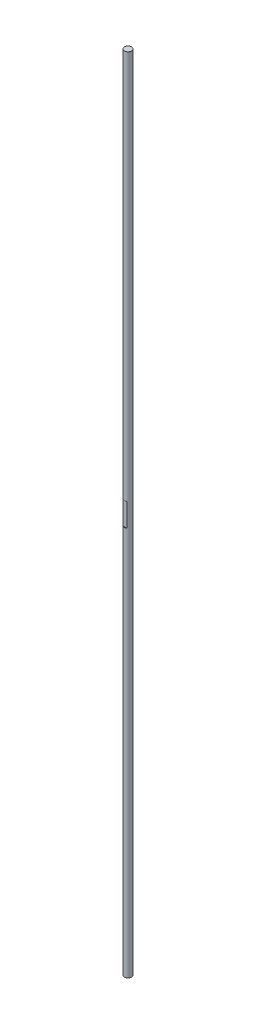
ISO-10303-21;
HEADER;
FILE_DESCRIPTION(('STEP AP214'),'2;1');
FILE_NAME('part.step','',(''),(''),'','','');
FILE_SCHEMA(('AUTOMOTIVE_DESIGN { 1 0 10303 214 1 1 1 1 }'));
ENDSEC;
DATA;
#1=APPLICATION_CONTEXT('core data for automotive mechanical design processes');
#2=APPLICATION_PROTOCOL_DEFINITION('international standard','automotive_design',2000,#1);
#3=PRODUCT_CONTEXT('',#1,'mechanical');
#4=PRODUCT('Part','Part','',(#3));
#5=PRODUCT_RELATED_PRODUCT_CATEGORY('part','',(#4));
#6=PRODUCT_DEFINITION_FORMATION('','',#4);
#7=PRODUCT_DEFINITION_CONTEXT('part definition',#1,'design');
#8=PRODUCT_DEFINITION('design','',#6,#7);
#9=PRODUCT_DEFINITION_SHAPE('','',#8);
#10=(LENGTH_UNIT() NAMED_UNIT(*) SI_UNIT(.MILLI.,.METRE.));
#11=(NAMED_UNIT(*) PLANE_ANGLE_UNIT() SI_UNIT($,.RADIAN.));
#12=(NAMED_UNIT(*) SI_UNIT($,.STERADIAN.) SOLID_ANGLE_UNIT());
#13=UNCERTAINTY_MEASURE_WITH_UNIT(LENGTH_MEASURE(1.E-05),#10,'distance_accuracy_value','');
#14=(GEOMETRIC_REPRESENTATION_CONTEXT(3) GLOBAL_UNCERTAINTY_ASSIGNED_CONTEXT((#13)) GLOBAL_UNIT_ASSIGNED_CONTEXT((#10,
#11,#12)) REPRESENTATION_CONTEXT('',''));
#15=CARTESIAN_POINT('',(0.,0.,0.));
#16=DIRECTION('',(0.,0.,1.));
#17=DIRECTION('',(1.,0.,0.));
#18=AXIS2_PLACEMENT_3D('',#15,#16,#17);
#19=CARTESIAN_POINT('',(51.5,-400.,247.));
#20=DIRECTION('',(0.,0.,-1.));
#21=DIRECTION('',(1.,0.,0.));
#22=AXIS2_PLACEMENT_3D('',#19,#20,#21);
#23=CYLINDRICAL_SURFACE('',#22,11.5);
#24=CARTESIAN_POINT('',(49.5404082059178,-388.668186377608,247.000000000098));
#25=CARTESIAN_POINT('',(49.5802265716879,-388.661301156045,247.026906778185));
#26=CARTESIAN_POINT('',(49.6206156905365,-388.654549375887,247.053003363505));
#27=CARTESIAN_POINT('',(49.7013684381463,-388.641515799974,247.102850981387));
#28=CARTESIAN_POINT('',(49.7417035325189,-388.635226247589,247.126646222982));
#29=CARTESIAN_POINT('',(49.822204416103,-388.623116839328,247.171982563202));
#30=CARTESIAN_POINT('',(49.862344146186,-388.617288810584,247.193567752785));
#31=CARTESIAN_POINT('',(49.9423209305092,-388.606103100956,247.234580960985));
#32=CARTESIAN_POINT('',(49.9821343153288,-388.600736770603,247.254052781727));
#33=CARTESIAN_POINT('',(50.0613358911731,-388.590474833857,247.290939987841));
#34=CARTESIAN_POINT('',(50.1007026955651,-388.585570069863,247.30839874868));
#35=CARTESIAN_POINT('',(50.1788989656807,-388.576232052942,247.341363614543));
#36=CARTESIAN_POINT('',(50.2177092228905,-388.571789078852,247.356912535919));
#37=CARTESIAN_POINT('',(50.2946903549696,-388.563374353632,247.386163636664));
#38=CARTESIAN_POINT('',(50.3328440910623,-388.559392301951,247.399907952862));
#39=CARTESIAN_POINT('',(50.4084197015294,-388.551903134911,247.425657109712));
#40=CARTESIAN_POINT('',(50.4458264027495,-388.548384961264,247.437703297109));
#41=CARTESIAN_POINT('',(50.525573279814,-388.541302800022,247.461908857835));
#42=CARTESIAN_POINT('',(50.5679662481753,-388.537784088522,247.47390795853));
#43=CARTESIAN_POINT('',(50.6528783635187,-388.531216704423,247.496218053491));
#44=CARTESIAN_POINT('',(50.6953940152595,-388.528164615717,247.506541354391));
#45=CARTESIAN_POINT('',(50.7804836777305,-388.522533736677,247.525519191767));
#46=CARTESIAN_POINT('',(50.8230547402374,-388.519951496019,247.534185919211));
#47=CARTESIAN_POINT('',(50.9081886750384,-388.515259461159,247.549872247178));
#48=CARTESIAN_POINT('',(50.950749136926,-388.513146216207,247.556903897834));
#49=CARTESIAN_POINT('',(51.0357976860111,-388.509392407807,247.569344203744));
#50=CARTESIAN_POINT('',(51.0782838823516,-388.507748387404,247.574764741622));
#51=CARTESIAN_POINT('',(51.1631218714194,-388.504932968074,247.584009207369));
#52=CARTESIAN_POINT('',(51.205472275454,-388.503758110849,247.587844825586));
#53=CARTESIAN_POINT('',(51.2899789311621,-388.501881047294,247.593947968214));
#54=CARTESIAN_POINT('',(51.3321342772806,-388.501175383426,247.596226967004));
#55=CARTESIAN_POINT('',(51.416193377034,-388.50023665462,247.599247364856));
#56=CARTESIAN_POINT('',(51.4580966883201,-388.50000013643,247.599999999991));
#57=CARTESIAN_POINT('',(51.5418964669691,-388.499999863593,247.600000000009));
#58=CARTESIAN_POINT('',(51.5837929343318,-388.500236031729,247.59924761075));
#59=CARTESIAN_POINT('',(51.6678403274889,-388.501174195813,247.596228127186));
#60=CARTESIAN_POINT('',(51.7099908082962,-388.501879668163,247.593949727995));
#61=CARTESIAN_POINT('',(51.7944897247599,-388.503756394353,247.587847998484));
#62=CARTESIAN_POINT('',(51.8368372494591,-388.504931127567,247.584013124055));
#63=CARTESIAN_POINT('',(51.9216714672081,-388.507746369338,247.574770148297));
#64=CARTESIAN_POINT('',(51.9641567633245,-388.509390357576,247.569350286102));
#65=CARTESIAN_POINT('',(52.0492054791702,-388.513144167399,247.556911120564));
#66=CARTESIAN_POINT('',(52.0917669968805,-388.515257466644,247.549879863426));
#67=CARTESIAN_POINT('',(52.1769049748802,-388.519949673379,247.534193896992));
#68=CARTESIAN_POINT('',(52.2194790106125,-388.522532051652,247.525527065879));
#69=CARTESIAN_POINT('',(52.3045764967026,-388.528163287912,247.506548381966));
#70=CARTESIAN_POINT('',(52.3470969816013,-388.531215615794,247.496224266151));
#71=CARTESIAN_POINT('',(52.4320205773531,-388.537783490753,247.473911687219));
#72=CARTESIAN_POINT('',(52.4744201726778,-388.541302472184,247.461910845181));
#73=CARTESIAN_POINT('',(52.5541696382366,-388.548384383302,247.437704498804));
#74=CARTESIAN_POINT('',(52.5915724251673,-388.551901932477,247.42565964507));
#75=CARTESIAN_POINT('',(52.6671414187627,-388.559390054133,247.399913041677));
#76=CARTESIAN_POINT('',(52.7052924393561,-388.563371699724,247.386169910926));
#77=CARTESIAN_POINT('',(52.7822693307091,-388.571785756128,247.356920956822));
#78=CARTESIAN_POINT('',(52.8210780479496,-388.576228478697,247.341372960254));
#79=CARTESIAN_POINT('',(52.8992723912365,-388.585566154712,247.308409606207));
#80=CARTESIAN_POINT('',(52.9386387917996,-388.590470839844,247.290951394145));
#81=CARTESIAN_POINT('',(53.0178406665885,-388.600732777273,247.254064829705));
#82=CARTESIAN_POINT('',(53.0576547348162,-388.606099196414,247.234593061917));
#83=CARTESIAN_POINT('',(53.1376339335556,-388.617285244519,247.193579382851));
#84=CARTESIAN_POINT('',(53.1777753726463,-388.623113531258,247.171993627976));
#85=CARTESIAN_POINT('',(53.2582806499379,-388.635223616669,247.126655457676));
#86=CARTESIAN_POINT('',(53.2986184041475,-388.641513595623,247.102858908493));
#87=CARTESIAN_POINT('',(53.3793773611664,-388.654548187854,247.053007853002));
#88=CARTESIAN_POINT('',(53.4197700016454,-388.661300564458,247.026909093778));
#89=CARTESIAN_POINT('',(53.4595917940823,-388.668186377608,247.000000000098));
#90=B_SPLINE_CURVE_WITH_KNOTS('',3,(#24,#25,#26,#27,#28,#29,#30,#31,#32,#33,#34,#35,#36,#37,#38,
#39,#40,#41,#42,#43,#44,#45,#46,#47,#48,#49,#50,#51,#52,#53,#54,#55,#56,#57,#58,#59,#60,#61,#62,
#63,#64,#65,#66,#67,#68,#69,#70,#71,#72,#73,#74,#75,#76,#77,#78,#79,#80,#81,#82,#83,#84,#85,#86,
#87,#88,#89),.UNSPECIFIED.,.F.,.F.,(4,2,2,2,2,2,2,2,2,2,2,2,2,2,2,2,2,2,2,2,2,2,2,2,2,2,2,2,2,2,
2,2,4),(0.,0.145633057423325,0.28734898562899,0.425153120973846,0.55905127202127,
0.689049775429505,0.815155560239854,0.93737622209787,1.05572010927034,1.18828186107212,
1.31982115521404,1.45035164280541,1.57988729395921,1.70844240318042,1.83603159460484,
1.9626698270645,2.08837239895365,2.21405443791298,2.34067799859689,2.46825838482187,
2.59681055861767,2.72634914521879,2.85688843825185,2.9884424050931,3.12102469237138,
3.23935606557156,3.36156778522122,3.48766820300885,3.617664916984,3.75156485777064,
3.88937436294669,4.03109924146039,4.17674482962278),.UNSPECIFIED.);
#91=CARTESIAN_POINT('',(49.5404082057735,-388.6681863764,247.));
#92=VERTEX_POINT('',#91);
#93=CARTESIAN_POINT('',(53.4595917942266,-388.6681863764,247.));
#94=VERTEX_POINT('',#93);
#95=EDGE_CURVE('E80',#92,#94,#90,.T.);
#96=ORIENTED_EDGE('',*,*,#95,.F.);
#97=CARTESIAN_POINT('',(51.5,-400.,247.));
#98=DIRECTION('',(0.,0.,1.));
#99=DIRECTION('',(1.,0.,0.));
#100=AXIS2_PLACEMENT_3D('',#97,#98,#99);
#101=CIRCLE('',#100,11.5);
#102=EDGE_CURVE('E11',#94,#92,#101,.T.);
#103=ORIENTED_EDGE('',*,*,#102,.F.);
#104=EDGE_LOOP('',(#96,#103));
#105=FACE_BOUND('',#104,.T.);
#106=ADVANCED_FACE('F16',(#105),#23,.F.);
#107=CARTESIAN_POINT('',(51.5,-400.,247.));
#108=DIRECTION('',(0.,0.,-1.));
#109=DIRECTION('',(1.,0.,0.));
#110=AXIS2_PLACEMENT_3D('',#107,#108,#109);
#111=CYLINDRICAL_SURFACE('',#110,11.5);
#112=CARTESIAN_POINT('',(53.4595917940822,-411.331813622392,247.000000000098));
#113=CARTESIAN_POINT('',(53.4197734280452,-411.338698844001,247.026906778366));
#114=CARTESIAN_POINT('',(53.3793843089224,-411.345450624206,247.053003363855));
#115=CARTESIAN_POINT('',(53.298631560829,-411.358484200198,247.102850982005));
#116=CARTESIAN_POINT('',(53.2582964662493,-411.364773752616,247.126646223701));
#117=CARTESIAN_POINT('',(53.177795582323,-411.37688316093,247.171982564064));
#118=CARTESIAN_POINT('',(53.1376558521069,-411.382711189694,247.193567753691));
#119=CARTESIAN_POINT('',(53.0576790675957,-411.393896899348,247.234580961927));
#120=CARTESIAN_POINT('',(53.017865682723,-411.399263229708,247.254052782666));
#121=CARTESIAN_POINT('',(52.9386641068554,-411.409525166454,247.29093998873));
#122=CARTESIAN_POINT('',(52.8992973024948,-411.414429930442,247.308398749526));
#123=CARTESIAN_POINT('',(52.8211010325292,-411.423767947336,247.341363615271));
#124=CARTESIAN_POINT('',(52.7822907754394,-411.428210921407,247.356912536575));
#125=CARTESIAN_POINT('',(52.7053096436905,-411.436625646574,247.386163637152));
#126=CARTESIAN_POINT('',(52.6671559078093,-411.440607698224,247.399907953259));
#127=CARTESIAN_POINT('',(52.5915802978574,-411.448096865183,247.42565710991));
#128=CARTESIAN_POINT('',(52.5541735969422,-411.451615038781,247.437703297202));
#129=CARTESIAN_POINT('',(52.4744267199433,-411.458697199978,247.461908857908));
#130=CARTESIAN_POINT('',(52.4320337513363,-411.462215911477,247.473907958668));
#131=CARTESIAN_POINT('',(52.3471216355674,-411.468783295573,247.496218053721));
#132=CARTESIAN_POINT('',(52.3046059836475,-411.47183538428,247.506541354652));
#133=CARTESIAN_POINT('',(52.2195163208866,-411.477466263321,247.525519192059));
#134=CARTESIAN_POINT('',(52.1769452582695,-411.480048503979,247.534185919506));
#135=CARTESIAN_POINT('',(52.0918113233186,-411.484740538839,247.54987224746));
#136=CARTESIAN_POINT('',(52.0492508613919,-411.486853783791,247.556903898102));
#137=CARTESIAN_POINT('',(51.9642023123007,-411.490607592192,247.569344203969));
#138=CARTESIAN_POINT('',(51.9217161159936,-411.492251612595,247.574764741822));
#139=CARTESIAN_POINT('',(51.8368781270656,-411.495067031925,247.584009207514));
#140=CARTESIAN_POINT('',(51.7945277231377,-411.49624188915,247.587844825704));
#141=CARTESIAN_POINT('',(51.7100210677164,-411.498118952705,247.593947968279));
#142=CARTESIAN_POINT('',(51.6678657217783,-411.498824616574,247.596226967047));
#143=CARTESIAN_POINT('',(51.5838066224587,-411.49976334538,247.599247364865));
#144=CARTESIAN_POINT('',(51.5419033114262,-411.499999863571,247.599999999991));
#145=CARTESIAN_POINT('',(51.4581035335356,-411.500000136406,247.600000000009));
#146=CARTESIAN_POINT('',(51.4162070666777,-411.49976396827,247.599247610769));
#147=CARTESIAN_POINT('',(51.332159674384,-411.498825804186,247.596228127271));
#148=CARTESIAN_POINT('',(51.2900091939355,-411.498120331835,247.593949728125));
#149=CARTESIAN_POINT('',(51.2055102780427,-411.496243605646,247.587847998718));
#150=CARTESIAN_POINT('',(51.1631627535558,-411.49506887243,247.584013124343));
#151=CARTESIAN_POINT('',(51.0783285360851,-411.492253630659,247.574770148696));
#152=CARTESIAN_POINT('',(51.0358432400351,-411.490609642421,247.569350286551));
#153=CARTESIAN_POINT('',(50.9507945241771,-411.486855832598,247.556911121097));
#154=CARTESIAN_POINT('',(50.908233006389,-411.484742533352,247.549879863987));
#155=CARTESIAN_POINT('',(50.8230950280911,-411.480050326617,247.53419389758));
#156=CARTESIAN_POINT('',(50.7805209921395,-411.477467948344,247.52552706646));
#157=CARTESIAN_POINT('',(50.6954235054726,-411.471836712083,247.506548382484));
#158=CARTESIAN_POINT('',(50.6529030202175,-411.468784384199,247.49622426661));
#159=CARTESIAN_POINT('',(50.5679794236189,-411.462216509244,247.473911687494));
#160=CARTESIAN_POINT('',(50.5255798278053,-411.458697527818,247.461910845327));
#161=CARTESIAN_POINT('',(50.4458303623764,-411.451615616789,247.43770449899));
#162=CARTESIAN_POINT('',(50.4084275760519,-411.44809806771,247.425659645463));
#163=CARTESIAN_POINT('',(50.332858583481,-411.440609946216,247.399913042465));
#164=CARTESIAN_POINT('',(50.294707563308,-411.436628300687,247.386169911897));
#165=CARTESIAN_POINT('',(50.2177306726117,-411.428214244387,247.356920958126));
#166=CARTESIAN_POINT('',(50.1789219556097,-411.423771521857,247.341372961701));
#167=CARTESIAN_POINT('',(50.1007276126211,-411.414433845895,247.308409607889));
#168=CARTESIAN_POINT('',(50.0613612121205,-411.409529160775,247.290951395911));
#169=CARTESIAN_POINT('',(49.9821593372853,-411.399267223346,247.25406483157));
#170=CARTESIAN_POINT('',(49.9423452689518,-411.393900804191,247.234593063791));
#171=CARTESIAN_POINT('',(49.8623660698386,-411.382714756034,247.193579384652));
#172=CARTESIAN_POINT('',(49.8222246304833,-411.376886469255,247.17199362969));
#173=CARTESIAN_POINT('',(49.7417193525114,-411.364776383739,247.126655459106));
#174=CARTESIAN_POINT('',(49.7013815978899,-411.358486404719,247.10285890972));
#175=CARTESIAN_POINT('',(49.6206226399095,-411.34545181233,247.053007853698));
#176=CARTESIAN_POINT('',(49.5802299988853,-411.338699435634,247.026909094137));
#177=CARTESIAN_POINT('',(49.5404082059178,-411.331813622392,247.000000000098));
#178=B_SPLINE_CURVE_WITH_KNOTS('',3,(#112,#113,#114,#115,#116,#117,#118,#119,#120,#121,#122,
#123,#124,#125,#126,#127,#128,#129,#130,#131,#132,#133,#134,#135,#136,#137,#138,#139,#140,#141,
#142,#143,#144,#145,#146,#147,#148,#149,#150,#151,#152,#153,#154,#155,#156,#157,#158,#159,#160,
#161,#162,#163,#164,#165,#166,#167,#168,#169,#170,#171,#172,#173,#174,#175,#176,#177),
.UNSPECIFIED.,.F.,.F.,(4,2,2,2,2,2,2,2,2,2,2,2,2,2,2,2,2,2,2,2,2,2,2,2,2,2,2,2,2,2,2,2,4),(0.,
0.145633058399175,0.287348987301878,0.425153123064897,0.559051274251693,0.68904977752057,
0.815155561912945,0.937376223074575,1.0557201092725,1.18828186183265,1.31982115651668,
1.45035164443352,1.57988729569588,1.70844240480848,1.83603159590697,1.96266982782327,
2.08837239895163,2.214054436397,2.34067799599965,2.46825838157602,2.59681055515569,
2.72634914197282,2.85688843565358,2.98844240357359,3.12102469236099,3.2393560636235,
3.36156778188854,3.48766819884514,3.61766491254321,3.75156485360698,3.88937435961448,
4.0310992395141,4.17674482961676),.UNSPECIFIED.);
#179=CARTESIAN_POINT('',(53.4595917942265,-411.3318136236,247.));
#180=VERTEX_POINT('',#179);
#181=CARTESIAN_POINT('',(49.5404082057735,-411.3318136236,247.));
#182=VERTEX_POINT('',#181);
#183=EDGE_CURVE('E61',#180,#182,#178,.T.);
#184=ORIENTED_EDGE('',*,*,#183,.F.);
#185=CARTESIAN_POINT('',(51.5,-400.,247.));
#186=DIRECTION('',(0.,0.,1.));
#187=DIRECTION('',(1.,0.,0.));
#188=AXIS2_PLACEMENT_3D('',#185,#186,#187);
#189=CIRCLE('',#188,11.5);
#190=EDGE_CURVE('E27',#182,#180,#189,.T.);
#191=ORIENTED_EDGE('',*,*,#190,.F.);
#192=EDGE_LOOP('',(#184,#191));
#193=FACE_BOUND('',#192,.T.);
#194=ADVANCED_FACE('F96',(#193),#111,.F.);
#195=CARTESIAN_POINT('',(51.5,-400.,247.));
#196=DIRECTION('',(0.,0.,1.));
#197=DIRECTION('',(1.,0.,0.));
#198=AXIS2_PLACEMENT_3D('',#195,#196,#197);
#199=PLANE('',#198);
#200=DIRECTION('',(0.,1.,0.));
#201=VECTOR('',#200,1.);
#202=CARTESIAN_POINT('',(49.5404082057734,-400.,247.));
#203=LINE('',#202,#201);
#204=EDGE_CURVE('E69',#182,#92,#203,.T.);
#205=ORIENTED_EDGE('',*,*,#204,.F.);
#206=ORIENTED_EDGE('',*,*,#190,.T.);
#207=DIRECTION('',(0.,-1.,0.));
#208=VECTOR('',#207,1.);
#209=CARTESIAN_POINT('',(53.4595917942266,-400.,247.));
#210=LINE('',#209,#208);
#211=EDGE_CURVE('E73',#94,#180,#210,.T.);
#212=ORIENTED_EDGE('',*,*,#211,.F.);
#213=ORIENTED_EDGE('',*,*,#102,.T.);
#214=EDGE_LOOP('',(#205,#206,#212,#213));
#215=FACE_BOUND('',#214,.T.);
#216=ADVANCED_FACE('F18',(#215),#199,.T.);
#217=CARTESIAN_POINT('',(51.5,-795.1,244.1));
#218=DIRECTION('',(0.,-1.,0.));
#219=DIRECTION('',(0.,0.,-1.));
#220=AXIS2_PLACEMENT_3D('',#217,#218,#219);
#221=PLANE('',#220);
#222=CARTESIAN_POINT('',(51.5,-795.1,244.1));
#223=DIRECTION('',(0.,-1.,0.));
#224=DIRECTION('',(1.,0.,0.));
#225=AXIS2_PLACEMENT_3D('',#222,#223,#224);
#226=CIRCLE('',#225,3.5);
#227=CARTESIAN_POINT('',(48.,-795.1,244.1));
#228=VERTEX_POINT('',#227);
#229=EDGE_CURVE('E38',#228,#228,#226,.T.);
#230=ORIENTED_EDGE('',*,*,#229,.T.);
#231=EDGE_LOOP('',(#230));
#232=FACE_BOUND('',#231,.T.);
#233=ADVANCED_FACE('F149',(#232),#221,.T.);
#234=CARTESIAN_POINT('',(51.5,-4.9,244.1));
#235=DIRECTION('',(0.,1.,0.));
#236=DIRECTION('',(1.,0.,0.));
#237=AXIS2_PLACEMENT_3D('',#234,#235,#236);
#238=PLANE('',#237);
#239=CARTESIAN_POINT('',(51.5,-4.9,244.1));
#240=DIRECTION('',(0.,1.,0.));
#241=DIRECTION('',(1.,0.,0.));
#242=AXIS2_PLACEMENT_3D('',#239,#240,#241);
#243=CIRCLE('',#242,3.5);
#244=CARTESIAN_POINT('',(48.,-4.9,244.1));
#245=VERTEX_POINT('',#244);
#246=EDGE_CURVE('E57',#245,#245,#243,.T.);
#247=ORIENTED_EDGE('',*,*,#246,.T.);
#248=EDGE_LOOP('',(#247));
#249=FACE_BOUND('',#248,.T.);
#250=ADVANCED_FACE('F58',(#249),#238,.T.);
#251=CARTESIAN_POINT('',(51.5,-400.,244.1));
#252=DIRECTION('',(0.,-1.,0.));
#253=DIRECTION('',(1.,0.,0.));
#254=AXIS2_PLACEMENT_3D('',#251,#252,#253);
#255=CYLINDRICAL_SURFACE('',#254,3.5);
#256=ORIENTED_EDGE('',*,*,#229,.F.);
#257=EDGE_LOOP('',(#256));
#258=FACE_BOUND('',#257,.T.);
#259=ORIENTED_EDGE('',*,*,#183,.T.);
#260=ORIENTED_EDGE('',*,*,#204,.T.);
#261=ORIENTED_EDGE('',*,*,#95,.T.);
#262=ORIENTED_EDGE('',*,*,#211,.T.);
#263=EDGE_LOOP('',(#259,#260,#261,#262));
#264=FACE_BOUND('',#263,.T.);
#265=ORIENTED_EDGE('',*,*,#246,.F.);
#266=EDGE_LOOP('',(#265));
#267=FACE_BOUND('',#266,.T.);
#268=ADVANCED_FACE('F86',(#258,#264,#267),#255,.T.);
#269=CLOSED_SHELL('',(#106,#194,#216,#233,#250,#268));
#270=MANIFOLD_SOLID_BREP('B1',#269);
#271=ADVANCED_BREP_SHAPE_REPRESENTATION('',(#18,#270),#14);
#272=SHAPE_DEFINITION_REPRESENTATION(#9,#271);
ENDSEC;
END-ISO-10303-21;
